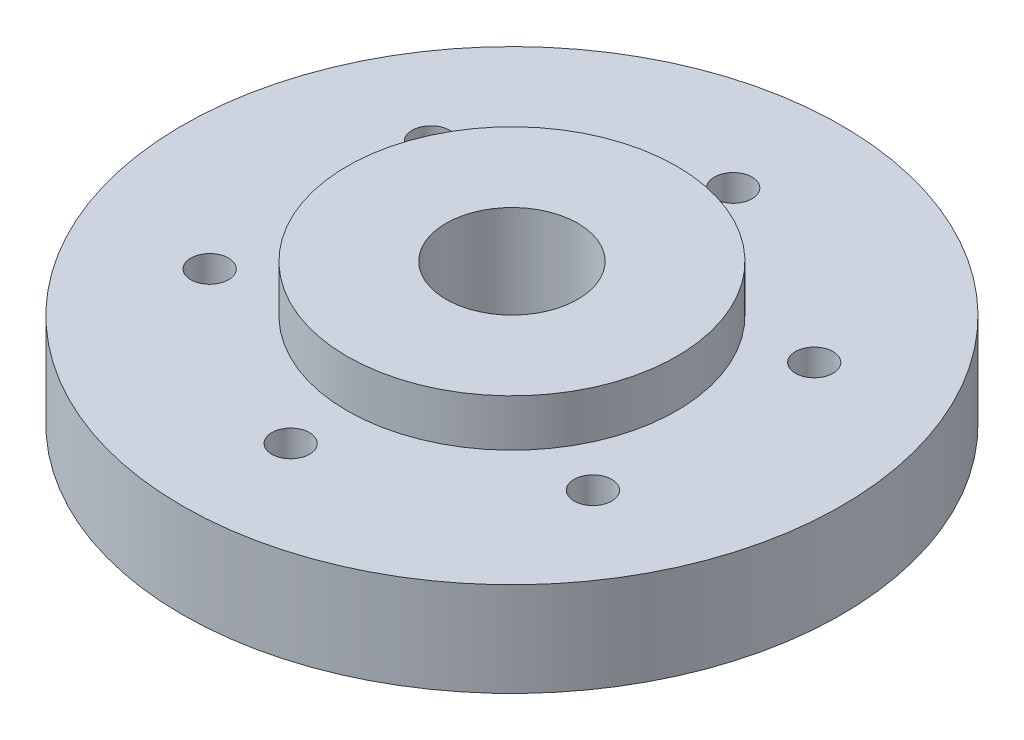
ISO-10303-21;
HEADER;
FILE_DESCRIPTION(('STEP AP214'),'2;1');
FILE_NAME('part.step','',(''),(''),'','','');
FILE_SCHEMA(('AUTOMOTIVE_DESIGN { 1 0 10303 214 1 1 1 1 }'));
ENDSEC;
DATA;
#1=APPLICATION_CONTEXT('core data for automotive mechanical design processes');
#2=APPLICATION_PROTOCOL_DEFINITION('international standard','automotive_design',2000,#1);
#3=PRODUCT_CONTEXT('',#1,'mechanical');
#4=PRODUCT('Part','Part','',(#3));
#5=PRODUCT_RELATED_PRODUCT_CATEGORY('part','',(#4));
#6=PRODUCT_DEFINITION_FORMATION('','',#4);
#7=PRODUCT_DEFINITION_CONTEXT('part definition',#1,'design');
#8=PRODUCT_DEFINITION('design','',#6,#7);
#9=PRODUCT_DEFINITION_SHAPE('','',#8);
#10=(LENGTH_UNIT() NAMED_UNIT(*) SI_UNIT(.MILLI.,.METRE.));
#11=(NAMED_UNIT(*) PLANE_ANGLE_UNIT() SI_UNIT($,.RADIAN.));
#12=(NAMED_UNIT(*) SI_UNIT($,.STERADIAN.) SOLID_ANGLE_UNIT());
#13=UNCERTAINTY_MEASURE_WITH_UNIT(LENGTH_MEASURE(1.E-05),#10,'distance_accuracy_value','');
#14=(GEOMETRIC_REPRESENTATION_CONTEXT(3) GLOBAL_UNCERTAINTY_ASSIGNED_CONTEXT((#13)) GLOBAL_UNIT_ASSIGNED_CONTEXT((#10,
#11,#12)) REPRESENTATION_CONTEXT('',''));
#15=CARTESIAN_POINT('',(0.,0.,0.));
#16=DIRECTION('',(0.,0.,1.));
#17=DIRECTION('',(1.,0.,0.));
#18=AXIS2_PLACEMENT_3D('',#15,#16,#17);
#19=CARTESIAN_POINT('',(0.,0.,-23.5));
#20=DIRECTION('',(0.,1.,0.));
#21=DIRECTION('',(0.,0.,1.));
#22=AXIS2_PLACEMENT_3D('',#19,#20,#21);
#23=CYLINDRICAL_SURFACE('',#22,2.);
#24=CARTESIAN_POINT('',(0.,10.,-23.5));
#25=DIRECTION('',(0.,1.,0.));
#26=DIRECTION('',(0.,0.,1.));
#27=AXIS2_PLACEMENT_3D('',#24,#25,#26);
#28=CIRCLE('',#27,2.);
#29=CARTESIAN_POINT('',(0.,10.,-21.5));
#30=VERTEX_POINT('',#29);
#31=EDGE_CURVE('E65',#30,#30,#28,.T.);
#32=ORIENTED_EDGE('',*,*,#31,.T.);
#33=EDGE_LOOP('',(#32));
#34=FACE_BOUND('',#33,.T.);
#35=CARTESIAN_POINT('',(0.,5.,-23.5));
#36=DIRECTION('',(0.,-1.,0.));
#37=DIRECTION('',(0.,0.,-1.));
#38=AXIS2_PLACEMENT_3D('',#35,#36,#37);
#39=CIRCLE('',#38,2.);
#40=CARTESIAN_POINT('',(0.,5.,-25.5));
#41=VERTEX_POINT('',#40);
#42=EDGE_CURVE('E111',#41,#41,#39,.T.);
#43=ORIENTED_EDGE('',*,*,#42,.T.);
#44=EDGE_LOOP('',(#43));
#45=FACE_BOUND('',#44,.T.);
#46=ADVANCED_FACE('F35',(#34,#45),#23,.F.);
#47=CARTESIAN_POINT('',(-20.3515969889338,0.,-11.7499999999991));
#48=DIRECTION('',(0.,1.,0.));
#49=DIRECTION('',(0.,0.,1.));
#50=AXIS2_PLACEMENT_3D('',#47,#48,#49);
#51=CYLINDRICAL_SURFACE('',#50,2.00000000000101);
#52=CARTESIAN_POINT('',(-20.3515969889338,10.,-11.7499999999991));
#53=DIRECTION('',(0.,1.,0.));
#54=DIRECTION('',(0.,0.,1.));
#55=AXIS2_PLACEMENT_3D('',#52,#53,#54);
#56=CIRCLE('',#55,2.00000000000101);
#57=CARTESIAN_POINT('',(-20.3515969889338,10.,-9.74999999999811));
#58=VERTEX_POINT('',#57);
#59=EDGE_CURVE('E71',#58,#58,#56,.T.);
#60=ORIENTED_EDGE('',*,*,#59,.T.);
#61=EDGE_LOOP('',(#60));
#62=FACE_BOUND('',#61,.T.);
#63=CARTESIAN_POINT('',(-20.3515969889338,5.,-11.7499999999991));
#64=DIRECTION('',(0.,-1.,0.));
#65=DIRECTION('',(0.,0.,-1.));
#66=AXIS2_PLACEMENT_3D('',#63,#64,#65);
#67=CIRCLE('',#66,2.00000000000101);
#68=CARTESIAN_POINT('',(-20.3515969889338,5.,-13.7500000000001));
#69=VERTEX_POINT('',#68);
#70=EDGE_CURVE('E102',#69,#69,#67,.T.);
#71=ORIENTED_EDGE('',*,*,#70,.T.);
#72=EDGE_LOOP('',(#71));
#73=FACE_BOUND('',#72,.T.);
#74=ADVANCED_FACE('F186',(#62,#73),#51,.F.);
#75=CARTESIAN_POINT('',(-20.3515969889328,0.,11.7500000000009));
#76=DIRECTION('',(0.,1.,0.));
#77=DIRECTION('',(0.,0.,1.));
#78=AXIS2_PLACEMENT_3D('',#75,#76,#77);
#79=CYLINDRICAL_SURFACE('',#78,2.0000000000019);
#80=CARTESIAN_POINT('',(-20.3515969889328,10.,11.7500000000009));
#81=DIRECTION('',(0.,1.,0.));
#82=DIRECTION('',(0.,0.,1.));
#83=AXIS2_PLACEMENT_3D('',#80,#81,#82);
#84=CIRCLE('',#83,2.0000000000019);
#85=CARTESIAN_POINT('',(-20.3515969889328,10.,13.7500000000028));
#86=VERTEX_POINT('',#85);
#87=EDGE_CURVE('E74',#86,#86,#84,.T.);
#88=ORIENTED_EDGE('',*,*,#87,.T.);
#89=EDGE_LOOP('',(#88));
#90=FACE_BOUND('',#89,.T.);
#91=CARTESIAN_POINT('',(-20.3515969889328,5.,11.7500000000009));
#92=DIRECTION('',(0.,-1.,0.));
#93=DIRECTION('',(0.,0.,-1.));
#94=AXIS2_PLACEMENT_3D('',#91,#92,#93);
#95=CIRCLE('',#94,2.0000000000019);
#96=CARTESIAN_POINT('',(-20.3515969889328,5.,9.74999999999897));
#97=VERTEX_POINT('',#96);
#98=EDGE_CURVE('E99',#97,#97,#95,.T.);
#99=ORIENTED_EDGE('',*,*,#98,.T.);
#100=EDGE_LOOP('',(#99));
#101=FACE_BOUND('',#100,.T.);
#102=ADVANCED_FACE('F192',(#90,#101),#79,.F.);
#103=CARTESIAN_POINT('',(20.3515969889358,0.,11.7499999999991));
#104=DIRECTION('',(0.,1.,0.));
#105=DIRECTION('',(0.,0.,1.));
#106=AXIS2_PLACEMENT_3D('',#103,#104,#105);
#107=CYLINDRICAL_SURFACE('',#106,2.00000000000129);
#108=CARTESIAN_POINT('',(20.3515969889358,10.,11.7499999999991));
#109=DIRECTION('',(0.,1.,0.));
#110=DIRECTION('',(0.,0.,1.));
#111=AXIS2_PLACEMENT_3D('',#108,#109,#110);
#112=CIRCLE('',#111,2.00000000000129);
#113=CARTESIAN_POINT('',(20.3515969889358,10.,13.7500000000004));
#114=VERTEX_POINT('',#113);
#115=EDGE_CURVE('E81',#114,#114,#112,.T.);
#116=ORIENTED_EDGE('',*,*,#115,.T.);
#117=EDGE_LOOP('',(#116));
#118=FACE_BOUND('',#117,.T.);
#119=CARTESIAN_POINT('',(20.3515969889358,5.,11.7499999999991));
#120=DIRECTION('',(0.,-1.,0.));
#121=DIRECTION('',(0.,0.,-1.));
#122=AXIS2_PLACEMENT_3D('',#119,#120,#121);
#123=CIRCLE('',#122,2.00000000000129);
#124=CARTESIAN_POINT('',(20.3515969889358,5.,9.74999999999784));
#125=VERTEX_POINT('',#124);
#126=EDGE_CURVE('E129',#125,#125,#123,.T.);
#127=ORIENTED_EDGE('',*,*,#126,.T.);
#128=EDGE_LOOP('',(#127));
#129=FACE_BOUND('',#128,.T.);
#130=ADVANCED_FACE('F140',(#118,#129),#107,.F.);
#131=CARTESIAN_POINT('',(20.3515969889348,0.,-11.7500000000009));
#132=DIRECTION('',(0.,1.,0.));
#133=DIRECTION('',(0.,0.,1.));
#134=AXIS2_PLACEMENT_3D('',#131,#132,#133);
#135=CYLINDRICAL_SURFACE('',#134,2.00000000000028);
#136=CARTESIAN_POINT('',(20.3515969889348,10.,-11.7500000000009));
#137=DIRECTION('',(0.,1.,0.));
#138=DIRECTION('',(0.,0.,1.));
#139=AXIS2_PLACEMENT_3D('',#136,#137,#138);
#140=CIRCLE('',#139,2.00000000000028);
#141=CARTESIAN_POINT('',(20.3515969889348,10.,-9.75000000000058));
#142=VERTEX_POINT('',#141);
#143=EDGE_CURVE('E70',#142,#142,#140,.T.);
#144=ORIENTED_EDGE('',*,*,#143,.T.);
#145=EDGE_LOOP('',(#144));
#146=FACE_BOUND('',#145,.T.);
#147=CARTESIAN_POINT('',(20.3515969889348,5.,-11.7500000000009));
#148=DIRECTION('',(0.,-1.,0.));
#149=DIRECTION('',(0.,0.,-1.));
#150=AXIS2_PLACEMENT_3D('',#147,#148,#149);
#151=CIRCLE('',#150,2.00000000000028);
#152=CARTESIAN_POINT('',(20.3515969889348,5.,-13.7500000000011));
#153=VERTEX_POINT('',#152);
#154=EDGE_CURVE('E120',#153,#153,#151,.T.);
#155=ORIENTED_EDGE('',*,*,#154,.T.);
#156=EDGE_LOOP('',(#155));
#157=FACE_BOUND('',#156,.T.);
#158=ADVANCED_FACE('F226',(#146,#157),#135,.F.);
#159=CARTESIAN_POINT('',(1.99797467488749E-12,0.,23.5));
#160=DIRECTION('',(0.,1.,0.));
#161=DIRECTION('',(0.,0.,1.));
#162=AXIS2_PLACEMENT_3D('',#159,#160,#161);
#163=CYLINDRICAL_SURFACE('',#162,2.00000000000207);
#164=CARTESIAN_POINT('',(1.99797467488749E-12,10.,23.5));
#165=DIRECTION('',(0.,1.,0.));
#166=DIRECTION('',(0.,0.,1.));
#167=AXIS2_PLACEMENT_3D('',#164,#165,#166);
#168=CIRCLE('',#167,2.00000000000207);
#169=CARTESIAN_POINT('',(1.99797467488749E-12,10.,25.5000000000021));
#170=VERTEX_POINT('',#169);
#171=EDGE_CURVE('E78',#170,#170,#168,.T.);
#172=ORIENTED_EDGE('',*,*,#171,.T.);
#173=EDGE_LOOP('',(#172));
#174=FACE_BOUND('',#173,.T.);
#175=CARTESIAN_POINT('',(1.99797467488749E-12,5.,23.5));
#176=DIRECTION('',(0.,-1.,0.));
#177=DIRECTION('',(0.,0.,-1.));
#178=AXIS2_PLACEMENT_3D('',#175,#176,#177);
#179=CIRCLE('',#178,2.00000000000207);
#180=CARTESIAN_POINT('',(1.99797467488749E-12,5.,21.4999999999979));
#181=VERTEX_POINT('',#180);
#182=EDGE_CURVE('E89',#181,#181,#179,.T.);
#183=ORIENTED_EDGE('',*,*,#182,.T.);
#184=EDGE_LOOP('',(#183));
#185=FACE_BOUND('',#184,.T.);
#186=ADVANCED_FACE('F222',(#174,#185),#163,.F.);
#187=CARTESIAN_POINT('',(0.,15.,0.));
#188=DIRECTION('',(0.,-1.,0.));
#189=DIRECTION('',(0.,0.,-1.));
#190=AXIS2_PLACEMENT_3D('',#187,#188,#189);
#191=CYLINDRICAL_SURFACE('',#190,35.);
#192=CARTESIAN_POINT('',(0.,0.,0.));
#193=DIRECTION('',(0.,1.,0.));
#194=DIRECTION('',(0.,0.,1.));
#195=AXIS2_PLACEMENT_3D('',#192,#193,#194);
#196=CIRCLE('',#195,35.);
#197=CARTESIAN_POINT('',(0.,0.,35.));
#198=VERTEX_POINT('',#197);
#199=EDGE_CURVE('E10',#198,#198,#196,.T.);
#200=ORIENTED_EDGE('',*,*,#199,.T.);
#201=EDGE_LOOP('',(#200));
#202=FACE_BOUND('',#201,.T.);
#203=CARTESIAN_POINT('',(0.,10.,0.));
#204=DIRECTION('',(0.,1.,0.));
#205=DIRECTION('',(0.,0.,1.));
#206=AXIS2_PLACEMENT_3D('',#203,#204,#205);
#207=CIRCLE('',#206,35.);
#208=CARTESIAN_POINT('',(0.,10.,35.));
#209=VERTEX_POINT('',#208);
#210=EDGE_CURVE('E56',#209,#209,#207,.T.);
#211=ORIENTED_EDGE('',*,*,#210,.F.);
#212=EDGE_LOOP('',(#211));
#213=FACE_BOUND('',#212,.T.);
#214=ADVANCED_FACE('F37',(#202,#213),#191,.T.);
#215=CARTESIAN_POINT('',(0.,15.,0.));
#216=DIRECTION('',(0.,1.,0.));
#217=DIRECTION('',(0.,0.,1.));
#218=AXIS2_PLACEMENT_3D('',#215,#216,#217);
#219=PLANE('',#218);
#220=CARTESIAN_POINT('',(0.,15.,0.));
#221=DIRECTION('',(0.,-1.,0.));
#222=DIRECTION('',(0.,0.,-1.));
#223=AXIS2_PLACEMENT_3D('',#220,#221,#222);
#224=CIRCLE('',#223,7.);
#225=CARTESIAN_POINT('',(0.,15.,-7.));
#226=VERTEX_POINT('',#225);
#227=EDGE_CURVE('E51',#226,#226,#224,.T.);
#228=ORIENTED_EDGE('',*,*,#227,.T.);
#229=EDGE_LOOP('',(#228));
#230=FACE_BOUND('',#229,.T.);
#231=CARTESIAN_POINT('',(0.,15.,0.));
#232=DIRECTION('',(0.,1.,0.));
#233=DIRECTION('',(0.,0.,1.));
#234=AXIS2_PLACEMENT_3D('',#231,#232,#233);
#235=CIRCLE('',#234,17.5);
#236=CARTESIAN_POINT('',(0.,15.,17.5));
#237=VERTEX_POINT('',#236);
#238=EDGE_CURVE('E62',#237,#237,#235,.T.);
#239=ORIENTED_EDGE('',*,*,#238,.T.);
#240=EDGE_LOOP('',(#239));
#241=FACE_BOUND('',#240,.T.);
#242=ADVANCED_FACE('F160',(#230,#241),#219,.T.);
#243=CARTESIAN_POINT('',(0.,0.,0.));
#244=DIRECTION('',(0.,1.,0.));
#245=DIRECTION('',(0.,0.,1.));
#246=AXIS2_PLACEMENT_3D('',#243,#244,#245);
#247=PLANE('',#246);
#248=CARTESIAN_POINT('',(20.3515969889358,0.,11.7499999999991));
#249=DIRECTION('',(0.,-1.,0.));
#250=DIRECTION('',(0.,0.,-1.));
#251=AXIS2_PLACEMENT_3D('',#248,#249,#250);
#252=CIRCLE('',#251,5.00000000000029);
#253=CARTESIAN_POINT('',(20.3515969889358,0.,6.74999999999884));
#254=VERTEX_POINT('',#253);
#255=EDGE_CURVE('E132',#254,#254,#252,.T.);
#256=ORIENTED_EDGE('',*,*,#255,.F.);
#257=EDGE_LOOP('',(#256));
#258=FACE_BOUND('',#257,.T.);
#259=CARTESIAN_POINT('',(20.3515969889348,0.,-11.7500000000009));
#260=DIRECTION('',(0.,-1.,0.));
#261=DIRECTION('',(0.,0.,-1.));
#262=AXIS2_PLACEMENT_3D('',#259,#260,#261);
#263=CIRCLE('',#262,5.00000000000128);
#264=CARTESIAN_POINT('',(20.3515969889348,0.,-16.7500000000021));
#265=VERTEX_POINT('',#264);
#266=EDGE_CURVE('E123',#265,#265,#263,.T.);
#267=ORIENTED_EDGE('',*,*,#266,.F.);
#268=EDGE_LOOP('',(#267));
#269=FACE_BOUND('',#268,.T.);
#270=CARTESIAN_POINT('',(0.,0.,-23.5));
#271=DIRECTION('',(0.,-1.,0.));
#272=DIRECTION('',(0.,0.,-1.));
#273=AXIS2_PLACEMENT_3D('',#270,#271,#272);
#274=CIRCLE('',#273,5.00000000000206);
#275=CARTESIAN_POINT('',(0.,0.,-28.5000000000021));
#276=VERTEX_POINT('',#275);
#277=EDGE_CURVE('E114',#276,#276,#274,.T.);
#278=ORIENTED_EDGE('',*,*,#277,.F.);
#279=EDGE_LOOP('',(#278));
#280=FACE_BOUND('',#279,.T.);
#281=CARTESIAN_POINT('',(-20.3515969889338,0.,-11.7499999999991));
#282=DIRECTION('',(0.,-1.,0.));
#283=DIRECTION('',(0.,0.,-1.));
#284=AXIS2_PLACEMENT_3D('',#281,#282,#283);
#285=CIRCLE('',#284,5.00000000000189);
#286=CARTESIAN_POINT('',(-20.3515969889338,0.,-16.750000000001));
#287=VERTEX_POINT('',#286);
#288=EDGE_CURVE('E105',#287,#287,#285,.T.);
#289=ORIENTED_EDGE('',*,*,#288,.F.);
#290=EDGE_LOOP('',(#289));
#291=FACE_BOUND('',#290,.T.);
#292=CARTESIAN_POINT('',(-20.3515969889328,0.,11.7500000000009));
#293=DIRECTION('',(0.,-1.,0.));
#294=DIRECTION('',(0.,0.,-1.));
#295=AXIS2_PLACEMENT_3D('',#292,#293,#294);
#296=CIRCLE('',#295,5.00000000000101);
#297=CARTESIAN_POINT('',(-20.3515969889328,0.,6.74999999999985));
#298=VERTEX_POINT('',#297);
#299=EDGE_CURVE('E95',#298,#298,#296,.T.);
#300=ORIENTED_EDGE('',*,*,#299,.F.);
#301=EDGE_LOOP('',(#300));
#302=FACE_BOUND('',#301,.T.);
#303=CARTESIAN_POINT('',(1.99797467488749E-12,0.,23.5));
#304=DIRECTION('',(0.,-1.,0.));
#305=DIRECTION('',(0.,0.,-1.));
#306=AXIS2_PLACEMENT_3D('',#303,#304,#305);
#307=CIRCLE('',#306,5.);
#308=CARTESIAN_POINT('',(1.99797467488749E-12,0.,18.5));
#309=VERTEX_POINT('',#308);
#310=EDGE_CURVE('E86',#309,#309,#307,.T.);
#311=ORIENTED_EDGE('',*,*,#310,.F.);
#312=EDGE_LOOP('',(#311));
#313=FACE_BOUND('',#312,.T.);
#314=CARTESIAN_POINT('',(0.,0.,0.));
#315=DIRECTION('',(0.,-1.,0.));
#316=DIRECTION('',(0.,0.,-1.));
#317=AXIS2_PLACEMENT_3D('',#314,#315,#316);
#318=CIRCLE('',#317,15.75);
#319=CARTESIAN_POINT('',(0.,0.,-15.75));
#320=VERTEX_POINT('',#319);
#321=EDGE_CURVE('E46',#320,#320,#318,.T.);
#322=ORIENTED_EDGE('',*,*,#321,.F.);
#323=EDGE_LOOP('',(#322));
#324=FACE_BOUND('',#323,.T.);
#325=ORIENTED_EDGE('',*,*,#199,.F.);
#326=EDGE_LOOP('',(#325));
#327=FACE_BOUND('',#326,.T.);
#328=ADVANCED_FACE('F156',(#258,#269,#280,#291,#302,#313,#324,#327),#247,.F.);
#329=CARTESIAN_POINT('',(0.,5.,0.));
#330=DIRECTION('',(0.,-1.,0.));
#331=DIRECTION('',(0.,0.,-1.));
#332=AXIS2_PLACEMENT_3D('',#329,#330,#331);
#333=CYLINDRICAL_SURFACE('',#332,15.75);
#334=CARTESIAN_POINT('',(0.,5.,0.));
#335=DIRECTION('',(0.,-1.,0.));
#336=DIRECTION('',(0.,0.,-1.));
#337=AXIS2_PLACEMENT_3D('',#334,#335,#336);
#338=CIRCLE('',#337,15.75);
#339=CARTESIAN_POINT('',(0.,5.,-15.75));
#340=VERTEX_POINT('',#339);
#341=EDGE_CURVE('E42',#340,#340,#338,.T.);
#342=ORIENTED_EDGE('',*,*,#341,.F.);
#343=EDGE_LOOP('',(#342));
#344=FACE_BOUND('',#343,.T.);
#345=ORIENTED_EDGE('',*,*,#321,.T.);
#346=EDGE_LOOP('',(#345));
#347=FACE_BOUND('',#346,.T.);
#348=ADVANCED_FACE('F159',(#344,#347),#333,.F.);
#349=CARTESIAN_POINT('',(0.,5.,0.));
#350=DIRECTION('',(0.,-1.,0.));
#351=DIRECTION('',(0.,0.,-1.));
#352=AXIS2_PLACEMENT_3D('',#349,#350,#351);
#353=PLANE('',#352);
#354=CARTESIAN_POINT('',(0.,5.,0.));
#355=DIRECTION('',(0.,-1.,0.));
#356=DIRECTION('',(0.,0.,-1.));
#357=AXIS2_PLACEMENT_3D('',#354,#355,#356);
#358=CIRCLE('',#357,7.);
#359=CARTESIAN_POINT('',(0.,5.,-7.));
#360=VERTEX_POINT('',#359);
#361=EDGE_CURVE('E53',#360,#360,#358,.T.);
#362=ORIENTED_EDGE('',*,*,#361,.F.);
#363=EDGE_LOOP('',(#362));
#364=FACE_BOUND('',#363,.T.);
#365=ORIENTED_EDGE('',*,*,#341,.T.);
#366=EDGE_LOOP('',(#365));
#367=FACE_BOUND('',#366,.T.);
#368=ADVANCED_FACE('F175',(#364,#367),#353,.T.);
#369=CARTESIAN_POINT('',(0.,15.,0.));
#370=DIRECTION('',(0.,-1.,0.));
#371=DIRECTION('',(0.,0.,-1.));
#372=AXIS2_PLACEMENT_3D('',#369,#370,#371);
#373=CYLINDRICAL_SURFACE('',#372,7.);
#374=ORIENTED_EDGE('',*,*,#227,.F.);
#375=EDGE_LOOP('',(#374));
#376=FACE_BOUND('',#375,.T.);
#377=ORIENTED_EDGE('',*,*,#361,.T.);
#378=EDGE_LOOP('',(#377));
#379=FACE_BOUND('',#378,.T.);
#380=ADVANCED_FACE('F181',(#376,#379),#373,.F.);
#381=CARTESIAN_POINT('',(0.,10.,0.));
#382=DIRECTION('',(0.,1.,0.));
#383=DIRECTION('',(0.,0.,1.));
#384=AXIS2_PLACEMENT_3D('',#381,#382,#383);
#385=PLANE('',#384);
#386=ORIENTED_EDGE('',*,*,#143,.F.);
#387=EDGE_LOOP('',(#386));
#388=FACE_BOUND('',#387,.T.);
#389=ORIENTED_EDGE('',*,*,#115,.F.);
#390=EDGE_LOOP('',(#389));
#391=FACE_BOUND('',#390,.T.);
#392=ORIENTED_EDGE('',*,*,#171,.F.);
#393=EDGE_LOOP('',(#392));
#394=FACE_BOUND('',#393,.T.);
#395=ORIENTED_EDGE('',*,*,#87,.F.);
#396=EDGE_LOOP('',(#395));
#397=FACE_BOUND('',#396,.T.);
#398=ORIENTED_EDGE('',*,*,#59,.F.);
#399=EDGE_LOOP('',(#398));
#400=FACE_BOUND('',#399,.T.);
#401=ORIENTED_EDGE('',*,*,#31,.F.);
#402=EDGE_LOOP('',(#401));
#403=FACE_BOUND('',#402,.T.);
#404=CARTESIAN_POINT('',(0.,10.,0.));
#405=DIRECTION('',(0.,1.,0.));
#406=DIRECTION('',(0.,0.,1.));
#407=AXIS2_PLACEMENT_3D('',#404,#405,#406);
#408=CIRCLE('',#407,17.5);
#409=CARTESIAN_POINT('',(0.,10.,17.5));
#410=VERTEX_POINT('',#409);
#411=EDGE_CURVE('E61',#410,#410,#408,.T.);
#412=ORIENTED_EDGE('',*,*,#411,.F.);
#413=EDGE_LOOP('',(#412));
#414=FACE_BOUND('',#413,.T.);
#415=ORIENTED_EDGE('',*,*,#210,.T.);
#416=EDGE_LOOP('',(#415));
#417=FACE_BOUND('',#416,.T.);
#418=ADVANCED_FACE('F202',(#388,#391,#394,#397,#400,#403,#414,#417),#385,.T.);
#419=CARTESIAN_POINT('',(0.,10.,0.));
#420=DIRECTION('',(0.,1.,0.));
#421=DIRECTION('',(0.,0.,1.));
#422=AXIS2_PLACEMENT_3D('',#419,#420,#421);
#423=CYLINDRICAL_SURFACE('',#422,17.5);
#424=ORIENTED_EDGE('',*,*,#411,.T.);
#425=EDGE_LOOP('',(#424));
#426=FACE_BOUND('',#425,.T.);
#427=ORIENTED_EDGE('',*,*,#238,.F.);
#428=EDGE_LOOP('',(#427));
#429=FACE_BOUND('',#428,.T.);
#430=ADVANCED_FACE('F198',(#426,#429),#423,.T.);
#431=CARTESIAN_POINT('',(1.99797467488749E-12,5.,23.5));
#432=DIRECTION('',(0.,-1.,0.));
#433=DIRECTION('',(0.,0.,-1.));
#434=AXIS2_PLACEMENT_3D('',#431,#432,#433);
#435=CYLINDRICAL_SURFACE('',#434,5.);
#436=CARTESIAN_POINT('',(1.99797467488749E-12,5.,23.5));
#437=DIRECTION('',(0.,-1.,0.));
#438=DIRECTION('',(0.,0.,-1.));
#439=AXIS2_PLACEMENT_3D('',#436,#437,#438);
#440=CIRCLE('',#439,5.);
#441=CARTESIAN_POINT('',(1.99797467488749E-12,5.,18.5));
#442=VERTEX_POINT('',#441);
#443=EDGE_CURVE('E75',#442,#442,#440,.T.);
#444=ORIENTED_EDGE('',*,*,#443,.F.);
#445=EDGE_LOOP('',(#444));
#446=FACE_BOUND('',#445,.T.);
#447=ORIENTED_EDGE('',*,*,#310,.T.);
#448=EDGE_LOOP('',(#447));
#449=FACE_BOUND('',#448,.T.);
#450=ADVANCED_FACE('F201',(#446,#449),#435,.F.);
#451=CARTESIAN_POINT('',(1.99797467488749E-12,5.,23.5));
#452=DIRECTION('',(0.,-1.,0.));
#453=DIRECTION('',(0.,0.,-1.));
#454=AXIS2_PLACEMENT_3D('',#451,#452,#453);
#455=PLANE('',#454);
#456=ORIENTED_EDGE('',*,*,#182,.F.);
#457=EDGE_LOOP('',(#456));
#458=FACE_BOUND('',#457,.T.);
#459=ORIENTED_EDGE('',*,*,#443,.T.);
#460=EDGE_LOOP('',(#459));
#461=FACE_BOUND('',#460,.T.);
#462=ADVANCED_FACE('F263',(#458,#461),#455,.T.);
#463=CARTESIAN_POINT('',(20.3515969889348,5.,-11.7500000000009));
#464=DIRECTION('',(0.,-1.,0.));
#465=DIRECTION('',(0.,0.,-1.));
#466=AXIS2_PLACEMENT_3D('',#463,#464,#465);
#467=CYLINDRICAL_SURFACE('',#466,5.00000000000128);
#468=CARTESIAN_POINT('',(20.3515969889348,5.,-11.7500000000009));
#469=DIRECTION('',(0.,-1.,0.));
#470=DIRECTION('',(0.,0.,-1.));
#471=AXIS2_PLACEMENT_3D('',#468,#469,#470);
#472=CIRCLE('',#471,5.00000000000128);
#473=CARTESIAN_POINT('',(20.3515969889348,5.,-16.7500000000021));
#474=VERTEX_POINT('',#473);
#475=EDGE_CURVE('E126',#474,#474,#472,.T.);
#476=ORIENTED_EDGE('',*,*,#475,.F.);
#477=EDGE_LOOP('',(#476));
#478=FACE_BOUND('',#477,.T.);
#479=ORIENTED_EDGE('',*,*,#266,.T.);
#480=EDGE_LOOP('',(#479));
#481=FACE_BOUND('',#480,.T.);
#482=ADVANCED_FACE('F266',(#478,#481),#467,.F.);
#483=CARTESIAN_POINT('',(20.3515969889348,5.,-11.7500000000009));
#484=DIRECTION('',(0.,-1.,0.));
#485=DIRECTION('',(0.,0.,-1.));
#486=AXIS2_PLACEMENT_3D('',#483,#484,#485);
#487=PLANE('',#486);
#488=ORIENTED_EDGE('',*,*,#154,.F.);
#489=EDGE_LOOP('',(#488));
#490=FACE_BOUND('',#489,.T.);
#491=ORIENTED_EDGE('',*,*,#475,.T.);
#492=EDGE_LOOP('',(#491));
#493=FACE_BOUND('',#492,.T.);
#494=ADVANCED_FACE('F152',(#490,#493),#487,.T.);
#495=CARTESIAN_POINT('',(20.3515969889358,5.,11.7499999999991));
#496=DIRECTION('',(0.,-1.,0.));
#497=DIRECTION('',(0.,0.,-1.));
#498=AXIS2_PLACEMENT_3D('',#495,#496,#497);
#499=CYLINDRICAL_SURFACE('',#498,5.00000000000029);
#500=CARTESIAN_POINT('',(20.3515969889358,5.,11.7499999999991));
#501=DIRECTION('',(0.,-1.,0.));
#502=DIRECTION('',(0.,0.,-1.));
#503=AXIS2_PLACEMENT_3D('',#500,#501,#502);
#504=CIRCLE('',#503,5.00000000000029);
#505=CARTESIAN_POINT('',(20.3515969889358,5.,6.74999999999884));
#506=VERTEX_POINT('',#505);
#507=EDGE_CURVE('E94',#506,#506,#504,.T.);
#508=ORIENTED_EDGE('',*,*,#507,.F.);
#509=EDGE_LOOP('',(#508));
#510=FACE_BOUND('',#509,.T.);
#511=ORIENTED_EDGE('',*,*,#255,.T.);
#512=EDGE_LOOP('',(#511));
#513=FACE_BOUND('',#512,.T.);
#514=ADVANCED_FACE('F146',(#510,#513),#499,.F.);
#515=CARTESIAN_POINT('',(20.3515969889358,5.,11.7499999999991));
#516=DIRECTION('',(0.,-1.,0.));
#517=DIRECTION('',(0.,0.,-1.));
#518=AXIS2_PLACEMENT_3D('',#515,#516,#517);
#519=PLANE('',#518);
#520=ORIENTED_EDGE('',*,*,#126,.F.);
#521=EDGE_LOOP('',(#520));
#522=FACE_BOUND('',#521,.T.);
#523=ORIENTED_EDGE('',*,*,#507,.T.);
#524=EDGE_LOOP('',(#523));
#525=FACE_BOUND('',#524,.T.);
#526=ADVANCED_FACE('F142',(#522,#525),#519,.T.);
#527=CARTESIAN_POINT('',(-20.3515969889328,5.,11.7500000000009));
#528=DIRECTION('',(0.,-1.,0.));
#529=DIRECTION('',(0.,0.,-1.));
#530=AXIS2_PLACEMENT_3D('',#527,#528,#529);
#531=CYLINDRICAL_SURFACE('',#530,5.00000000000101);
#532=CARTESIAN_POINT('',(-20.3515969889328,5.,11.7500000000009));
#533=DIRECTION('',(0.,-1.,0.));
#534=DIRECTION('',(0.,0.,-1.));
#535=AXIS2_PLACEMENT_3D('',#532,#533,#534);
#536=CIRCLE('',#535,5.00000000000101);
#537=CARTESIAN_POINT('',(-20.3515969889328,5.,6.74999999999985));
#538=VERTEX_POINT('',#537);
#539=EDGE_CURVE('E98',#538,#538,#536,.T.);
#540=ORIENTED_EDGE('',*,*,#539,.F.);
#541=EDGE_LOOP('',(#540));
#542=FACE_BOUND('',#541,.T.);
#543=ORIENTED_EDGE('',*,*,#299,.T.);
#544=EDGE_LOOP('',(#543));
#545=FACE_BOUND('',#544,.T.);
#546=ADVANCED_FACE('F145',(#542,#545),#531,.F.);
#547=CARTESIAN_POINT('',(-20.3515969889328,5.,11.7500000000009));
#548=DIRECTION('',(0.,-1.,0.));
#549=DIRECTION('',(0.,0.,-1.));
#550=AXIS2_PLACEMENT_3D('',#547,#548,#549);
#551=PLANE('',#550);
#552=ORIENTED_EDGE('',*,*,#98,.F.);
#553=EDGE_LOOP('',(#552));
#554=FACE_BOUND('',#553,.T.);
#555=ORIENTED_EDGE('',*,*,#539,.T.);
#556=EDGE_LOOP('',(#555));
#557=FACE_BOUND('',#556,.T.);
#558=ADVANCED_FACE('F249',(#554,#557),#551,.T.);
#559=CARTESIAN_POINT('',(-20.3515969889338,5.,-11.7499999999991));
#560=DIRECTION('',(0.,-1.,0.));
#561=DIRECTION('',(0.,0.,-1.));
#562=AXIS2_PLACEMENT_3D('',#559,#560,#561);
#563=CYLINDRICAL_SURFACE('',#562,5.00000000000189);
#564=CARTESIAN_POINT('',(-20.3515969889338,5.,-11.7499999999991));
#565=DIRECTION('',(0.,-1.,0.));
#566=DIRECTION('',(0.,0.,-1.));
#567=AXIS2_PLACEMENT_3D('',#564,#565,#566);
#568=CIRCLE('',#567,5.00000000000189);
#569=CARTESIAN_POINT('',(-20.3515969889338,5.,-16.750000000001));
#570=VERTEX_POINT('',#569);
#571=EDGE_CURVE('E108',#570,#570,#568,.T.);
#572=ORIENTED_EDGE('',*,*,#571,.F.);
#573=EDGE_LOOP('',(#572));
#574=FACE_BOUND('',#573,.T.);
#575=ORIENTED_EDGE('',*,*,#288,.T.);
#576=EDGE_LOOP('',(#575));
#577=FACE_BOUND('',#576,.T.);
#578=ADVANCED_FACE('F252',(#574,#577),#563,.F.);
#579=CARTESIAN_POINT('',(-20.3515969889338,5.,-11.7499999999991));
#580=DIRECTION('',(0.,-1.,0.));
#581=DIRECTION('',(0.,0.,-1.));
#582=AXIS2_PLACEMENT_3D('',#579,#580,#581);
#583=PLANE('',#582);
#584=ORIENTED_EDGE('',*,*,#70,.F.);
#585=EDGE_LOOP('',(#584));
#586=FACE_BOUND('',#585,.T.);
#587=ORIENTED_EDGE('',*,*,#571,.T.);
#588=EDGE_LOOP('',(#587));
#589=FACE_BOUND('',#588,.T.);
#590=ADVANCED_FACE('F323',(#586,#589),#583,.T.);
#591=CARTESIAN_POINT('',(0.,5.,-23.5));
#592=DIRECTION('',(0.,-1.,0.));
#593=DIRECTION('',(0.,0.,-1.));
#594=AXIS2_PLACEMENT_3D('',#591,#592,#593);
#595=CYLINDRICAL_SURFACE('',#594,5.00000000000206);
#596=CARTESIAN_POINT('',(0.,5.,-23.5));
#597=DIRECTION('',(0.,-1.,0.));
#598=DIRECTION('',(0.,0.,-1.));
#599=AXIS2_PLACEMENT_3D('',#596,#597,#598);
#600=CIRCLE('',#599,5.00000000000206);
#601=CARTESIAN_POINT('',(0.,5.,-28.5000000000021));
#602=VERTEX_POINT('',#601);
#603=EDGE_CURVE('E117',#602,#602,#600,.T.);
#604=ORIENTED_EDGE('',*,*,#603,.F.);
#605=EDGE_LOOP('',(#604));
#606=FACE_BOUND('',#605,.T.);
#607=ORIENTED_EDGE('',*,*,#277,.T.);
#608=EDGE_LOOP('',(#607));
#609=FACE_BOUND('',#608,.T.);
#610=ADVANCED_FACE('F332',(#606,#609),#595,.F.);
#611=CARTESIAN_POINT('',(0.,5.,-23.5));
#612=DIRECTION('',(0.,-1.,0.));
#613=DIRECTION('',(0.,0.,-1.));
#614=AXIS2_PLACEMENT_3D('',#611,#612,#613);
#615=PLANE('',#614);
#616=ORIENTED_EDGE('',*,*,#42,.F.);
#617=EDGE_LOOP('',(#616));
#618=FACE_BOUND('',#617,.T.);
#619=ORIENTED_EDGE('',*,*,#603,.T.);
#620=EDGE_LOOP('',(#619));
#621=FACE_BOUND('',#620,.T.);
#622=ADVANCED_FACE('F342',(#618,#621),#615,.T.);
#623=CLOSED_SHELL('',(#46,#74,#102,#130,#158,#186,#214,#242,#328,#348,#368,#380,#418,#430,#450,
#462,#482,#494,#514,#526,#546,#558,#578,#590,#610,#622));
#624=MANIFOLD_SOLID_BREP('B2',#623);
#625=ADVANCED_BREP_SHAPE_REPRESENTATION('',(#18,#624),#14);
#626=SHAPE_DEFINITION_REPRESENTATION(#9,#625);
ENDSEC;
END-ISO-10303-21;
